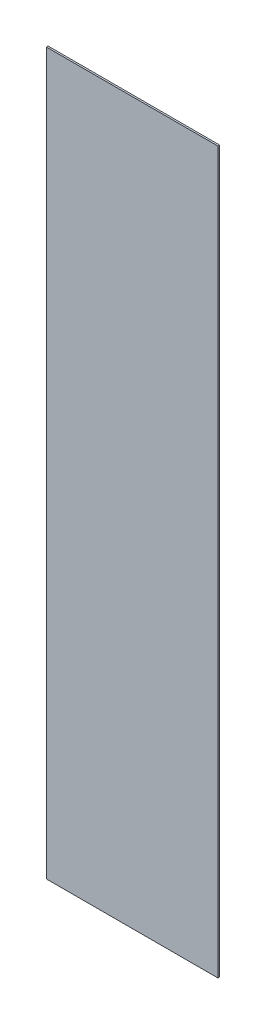
ISO-10303-21;
HEADER;
FILE_DESCRIPTION(('STEP AP214'),'2;1');
FILE_NAME('part.step','',(''),(''),'','','');
FILE_SCHEMA(('AUTOMOTIVE_DESIGN { 1 0 10303 214 1 1 1 1 }'));
ENDSEC;
DATA;
#1=APPLICATION_CONTEXT('core data for automotive mechanical design processes');
#2=APPLICATION_PROTOCOL_DEFINITION('international standard','automotive_design',2000,#1);
#3=PRODUCT_CONTEXT('',#1,'mechanical');
#4=PRODUCT('Part','Part','',(#3));
#5=PRODUCT_RELATED_PRODUCT_CATEGORY('part','',(#4));
#6=PRODUCT_DEFINITION_FORMATION('','',#4);
#7=PRODUCT_DEFINITION_CONTEXT('part definition',#1,'design');
#8=PRODUCT_DEFINITION('design','',#6,#7);
#9=PRODUCT_DEFINITION_SHAPE('','',#8);
#10=(LENGTH_UNIT() NAMED_UNIT(*) SI_UNIT(.MILLI.,.METRE.));
#11=(NAMED_UNIT(*) PLANE_ANGLE_UNIT() SI_UNIT($,.RADIAN.));
#12=(NAMED_UNIT(*) SI_UNIT($,.STERADIAN.) SOLID_ANGLE_UNIT());
#13=UNCERTAINTY_MEASURE_WITH_UNIT(LENGTH_MEASURE(1.E-05),#10,'distance_accuracy_value','');
#14=(GEOMETRIC_REPRESENTATION_CONTEXT(3) GLOBAL_UNCERTAINTY_ASSIGNED_CONTEXT((#13)) GLOBAL_UNIT_ASSIGNED_CONTEXT((#10,
#11,#12)) REPRESENTATION_CONTEXT('',''));
#15=CARTESIAN_POINT('',(0.,0.,0.));
#16=DIRECTION('',(0.,0.,1.));
#17=DIRECTION('',(1.,0.,0.));
#18=AXIS2_PLACEMENT_3D('',#15,#16,#17);
#19=CARTESIAN_POINT('',(25.,105.,0.5));
#20=DIRECTION('',(-1.,0.,0.));
#21=DIRECTION('',(0.,-1.,0.));
#22=AXIS2_PLACEMENT_3D('',#19,#20,#21);
#23=PLANE('',#22);
#24=DIRECTION('',(0.,1.,0.));
#25=VECTOR('',#24,1.);
#26=CARTESIAN_POINT('',(25.,105.,0.));
#27=LINE('',#26,#25);
#28=CARTESIAN_POINT('',(25.,-105.,0.));
#29=VERTEX_POINT('',#28);
#30=CARTESIAN_POINT('',(25.,105.,0.));
#31=VERTEX_POINT('',#30);
#32=EDGE_CURVE('E96',#29,#31,#27,.T.);
#33=ORIENTED_EDGE('',*,*,#32,.T.);
#34=DIRECTION('',(0.,0.,-1.));
#35=VECTOR('',#34,1.);
#36=CARTESIAN_POINT('',(25.,105.,0.5));
#37=LINE('',#36,#35);
#38=CARTESIAN_POINT('',(25.,105.,0.5));
#39=VERTEX_POINT('',#38);
#40=EDGE_CURVE('E11',#39,#31,#37,.T.);
#41=ORIENTED_EDGE('',*,*,#40,.F.);
#42=DIRECTION('',(0.,1.,0.));
#43=VECTOR('',#42,1.);
#44=CARTESIAN_POINT('',(25.,105.,0.5));
#45=LINE('',#44,#43);
#46=CARTESIAN_POINT('',(25.,-105.,0.5));
#47=VERTEX_POINT('',#46);
#48=EDGE_CURVE('E84',#47,#39,#45,.T.);
#49=ORIENTED_EDGE('',*,*,#48,.F.);
#50=DIRECTION('',(0.,0.,-1.));
#51=VECTOR('',#50,1.);
#52=CARTESIAN_POINT('',(25.,-105.,0.5));
#53=LINE('',#52,#51);
#54=EDGE_CURVE('E92',#47,#29,#53,.T.);
#55=ORIENTED_EDGE('',*,*,#54,.T.);
#56=EDGE_LOOP('',(#33,#41,#49,#55));
#57=FACE_BOUND('',#56,.T.);
#58=ADVANCED_FACE('F33',(#57),#23,.F.);
#59=CARTESIAN_POINT('',(-25.,105.,0.5));
#60=DIRECTION('',(0.,-1.,0.));
#61=DIRECTION('',(0.,0.,-1.));
#62=AXIS2_PLACEMENT_3D('',#59,#60,#61);
#63=PLANE('',#62);
#64=DIRECTION('',(-1.,0.,0.));
#65=VECTOR('',#64,1.);
#66=CARTESIAN_POINT('',(-25.,105.,0.));
#67=LINE('',#66,#65);
#68=CARTESIAN_POINT('',(-25.,105.,0.));
#69=VERTEX_POINT('',#68);
#70=EDGE_CURVE('E88',#31,#69,#67,.T.);
#71=ORIENTED_EDGE('',*,*,#70,.T.);
#72=DIRECTION('',(0.,0.,-1.));
#73=VECTOR('',#72,1.);
#74=CARTESIAN_POINT('',(-25.,105.,0.5));
#75=LINE('',#74,#73);
#76=CARTESIAN_POINT('',(-25.,105.,0.5));
#77=VERTEX_POINT('',#76);
#78=EDGE_CURVE('E41',#77,#69,#75,.T.);
#79=ORIENTED_EDGE('',*,*,#78,.F.);
#80=DIRECTION('',(-1.,0.,0.));
#81=VECTOR('',#80,1.);
#82=CARTESIAN_POINT('',(-25.,105.,0.5));
#83=LINE('',#82,#81);
#84=EDGE_CURVE('E79',#39,#77,#83,.T.);
#85=ORIENTED_EDGE('',*,*,#84,.F.);
#86=ORIENTED_EDGE('',*,*,#40,.T.);
#87=EDGE_LOOP('',(#71,#79,#85,#86));
#88=FACE_BOUND('',#87,.T.);
#89=ADVANCED_FACE('F87',(#88),#63,.F.);
#90=CARTESIAN_POINT('',(-25.,105.,0.5));
#91=DIRECTION('',(1.,0.,0.));
#92=DIRECTION('',(0.,1.,0.));
#93=AXIS2_PLACEMENT_3D('',#90,#91,#92);
#94=PLANE('',#93);
#95=DIRECTION('',(0.,-1.,0.));
#96=VECTOR('',#95,1.);
#97=CARTESIAN_POINT('',(-25.,105.,0.));
#98=LINE('',#97,#96);
#99=CARTESIAN_POINT('',(-25.,-105.,0.));
#100=VERTEX_POINT('',#99);
#101=EDGE_CURVE('E66',#69,#100,#98,.T.);
#102=ORIENTED_EDGE('',*,*,#101,.T.);
#103=DIRECTION('',(0.,0.,-1.));
#104=VECTOR('',#103,1.);
#105=CARTESIAN_POINT('',(-25.,-105.,0.5));
#106=LINE('',#105,#104);
#107=CARTESIAN_POINT('',(-25.,-105.,0.5));
#108=VERTEX_POINT('',#107);
#109=EDGE_CURVE('E89',#108,#100,#106,.T.);
#110=ORIENTED_EDGE('',*,*,#109,.F.);
#111=DIRECTION('',(0.,-1.,0.));
#112=VECTOR('',#111,1.);
#113=CARTESIAN_POINT('',(-25.,105.,0.5));
#114=LINE('',#113,#112);
#115=EDGE_CURVE('E82',#77,#108,#114,.T.);
#116=ORIENTED_EDGE('',*,*,#115,.F.);
#117=ORIENTED_EDGE('',*,*,#78,.T.);
#118=EDGE_LOOP('',(#102,#110,#116,#117));
#119=FACE_BOUND('',#118,.T.);
#120=ADVANCED_FACE('F90',(#119),#94,.F.);
#121=CARTESIAN_POINT('',(-25.,-105.,0.5));
#122=DIRECTION('',(0.,1.,0.));
#123=DIRECTION('',(0.,0.,1.));
#124=AXIS2_PLACEMENT_3D('',#121,#122,#123);
#125=PLANE('',#124);
#126=DIRECTION('',(1.,0.,0.));
#127=VECTOR('',#126,1.);
#128=CARTESIAN_POINT('',(-25.,-105.,0.));
#129=LINE('',#128,#127);
#130=EDGE_CURVE('E72',#100,#29,#129,.T.);
#131=ORIENTED_EDGE('',*,*,#130,.T.);
#132=ORIENTED_EDGE('',*,*,#54,.F.);
#133=DIRECTION('',(1.,0.,0.));
#134=VECTOR('',#133,1.);
#135=CARTESIAN_POINT('',(-25.,-105.,0.5));
#136=LINE('',#135,#134);
#137=EDGE_CURVE('E49',#108,#47,#136,.T.);
#138=ORIENTED_EDGE('',*,*,#137,.F.);
#139=ORIENTED_EDGE('',*,*,#109,.T.);
#140=EDGE_LOOP('',(#131,#132,#138,#139));
#141=FACE_BOUND('',#140,.T.);
#142=ADVANCED_FACE('F103',(#141),#125,.F.);
#143=CARTESIAN_POINT('',(0.,0.,0.5));
#144=DIRECTION('',(0.,0.,1.));
#145=DIRECTION('',(1.,0.,0.));
#146=AXIS2_PLACEMENT_3D('',#143,#144,#145);
#147=PLANE('',#146);
#148=ORIENTED_EDGE('',*,*,#48,.T.);
#149=ORIENTED_EDGE('',*,*,#84,.T.);
#150=ORIENTED_EDGE('',*,*,#115,.T.);
#151=ORIENTED_EDGE('',*,*,#137,.T.);
#152=EDGE_LOOP('',(#148,#149,#150,#151));
#153=FACE_BOUND('',#152,.T.);
#154=ADVANCED_FACE('F80',(#153),#147,.T.);
#155=CARTESIAN_POINT('',(0.,0.,0.));
#156=DIRECTION('',(0.,0.,1.));
#157=DIRECTION('',(1.,0.,0.));
#158=AXIS2_PLACEMENT_3D('',#155,#156,#157);
#159=PLANE('',#158);
#160=ORIENTED_EDGE('',*,*,#32,.F.);
#161=ORIENTED_EDGE('',*,*,#130,.F.);
#162=ORIENTED_EDGE('',*,*,#101,.F.);
#163=ORIENTED_EDGE('',*,*,#70,.F.);
#164=EDGE_LOOP('',(#160,#161,#162,#163));
#165=FACE_BOUND('',#164,.T.);
#166=ADVANCED_FACE('F106',(#165),#159,.F.);
#167=CLOSED_SHELL('',(#58,#89,#120,#142,#154,#166));
#168=MANIFOLD_SOLID_BREP('B2',#167);
#169=ADVANCED_BREP_SHAPE_REPRESENTATION('',(#18,#168),#14);
#170=SHAPE_DEFINITION_REPRESENTATION(#9,#169);
ENDSEC;
END-ISO-10303-21;
